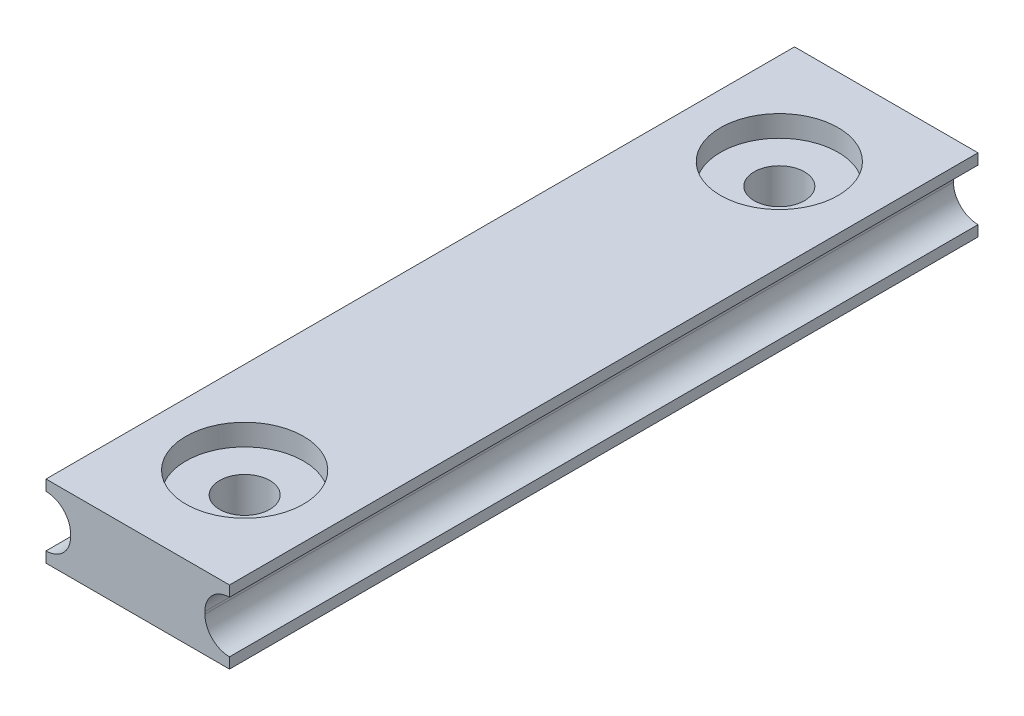
ISO-10303-21;
HEADER;
FILE_DESCRIPTION(('STEP AP214'),'2;1');
FILE_NAME('part.step','',(''),(''),'','','');
FILE_SCHEMA(('AUTOMOTIVE_DESIGN { 1 0 10303 214 1 1 1 1 }'));
ENDSEC;
DATA;
#1=APPLICATION_CONTEXT('core data for automotive mechanical design processes');
#2=APPLICATION_PROTOCOL_DEFINITION('international standard','automotive_design',2000,#1);
#3=PRODUCT_CONTEXT('',#1,'mechanical');
#4=PRODUCT('Part','Part','',(#3));
#5=PRODUCT_RELATED_PRODUCT_CATEGORY('part','',(#4));
#6=PRODUCT_DEFINITION_FORMATION('','',#4);
#7=PRODUCT_DEFINITION_CONTEXT('part definition',#1,'design');
#8=PRODUCT_DEFINITION('design','',#6,#7);
#9=PRODUCT_DEFINITION_SHAPE('','',#8);
#10=(LENGTH_UNIT() NAMED_UNIT(*) SI_UNIT(.MILLI.,.METRE.));
#11=(NAMED_UNIT(*) PLANE_ANGLE_UNIT() SI_UNIT($,.RADIAN.));
#12=(NAMED_UNIT(*) SI_UNIT($,.STERADIAN.) SOLID_ANGLE_UNIT());
#13=UNCERTAINTY_MEASURE_WITH_UNIT(LENGTH_MEASURE(1.E-05),#10,'distance_accuracy_value','');
#14=(GEOMETRIC_REPRESENTATION_CONTEXT(3) GLOBAL_UNCERTAINTY_ASSIGNED_CONTEXT((#13)) GLOBAL_UNIT_ASSIGNED_CONTEXT((#10,
#11,#12)) REPRESENTATION_CONTEXT('',''));
#15=CARTESIAN_POINT('',(0.,0.,0.));
#16=DIRECTION('',(0.,0.,1.));
#17=DIRECTION('',(1.,0.,0.));
#18=AXIS2_PLACEMENT_3D('',#15,#16,#17);
#19=CARTESIAN_POINT('',(-4.29,1.705,17.5));
#20=DIRECTION('',(0.,-1.,0.));
#21=DIRECTION('',(0.,0.,-1.));
#22=AXIS2_PLACEMENT_3D('',#19,#20,#21);
#23=PLANE('',#22);
#24=CARTESIAN_POINT('',(0.,1.705,-12.5));
#25=DIRECTION('',(0.,1.,0.));
#26=DIRECTION('',(0.,0.,1.));
#27=AXIS2_PLACEMENT_3D('',#24,#25,#26);
#28=CIRCLE('',#27,2.75);
#29=CARTESIAN_POINT('',(0.,1.705,-9.75));
#30=VERTEX_POINT('',#29);
#31=EDGE_CURVE('E210',#30,#30,#28,.T.);
#32=ORIENTED_EDGE('',*,*,#31,.F.);
#33=EDGE_LOOP('',(#32));
#34=FACE_BOUND('',#33,.T.);
#35=DIRECTION('',(-1.,0.,0.));
#36=VECTOR('',#35,1.);
#37=CARTESIAN_POINT('',(-4.29,1.705,-17.5));
#38=LINE('',#37,#36);
#39=CARTESIAN_POINT('',(4.29,1.705,-17.5));
#40=VERTEX_POINT('',#39);
#41=CARTESIAN_POINT('',(-4.29,1.705,-17.5));
#42=VERTEX_POINT('',#41);
#43=EDGE_CURVE('E99',#40,#42,#38,.T.);
#44=ORIENTED_EDGE('',*,*,#43,.T.);
#45=DIRECTION('',(0.,0.,-1.));
#46=VECTOR('',#45,1.);
#47=CARTESIAN_POINT('',(-4.29,1.705,17.5));
#48=LINE('',#47,#46);
#49=CARTESIAN_POINT('',(-4.29,1.705,17.5));
#50=VERTEX_POINT('',#49);
#51=EDGE_CURVE('E152',#50,#42,#48,.T.);
#52=ORIENTED_EDGE('',*,*,#51,.F.);
#53=DIRECTION('',(-1.,0.,0.));
#54=VECTOR('',#53,1.);
#55=CARTESIAN_POINT('',(-4.29,1.705,17.5));
#56=LINE('',#55,#54);
#57=CARTESIAN_POINT('',(4.29,1.705,17.5));
#58=VERTEX_POINT('',#57);
#59=EDGE_CURVE('E52',#58,#50,#56,.T.);
#60=ORIENTED_EDGE('',*,*,#59,.F.);
#61=DIRECTION('',(0.,0.,-1.));
#62=VECTOR('',#61,1.);
#63=CARTESIAN_POINT('',(4.29,1.705,17.5));
#64=LINE('',#63,#62);
#65=EDGE_CURVE('E148',#58,#40,#64,.T.);
#66=ORIENTED_EDGE('',*,*,#65,.T.);
#67=EDGE_LOOP('',(#44,#52,#60,#66));
#68=FACE_BOUND('',#67,.T.);
#69=CARTESIAN_POINT('',(0.,1.705,12.5));
#70=DIRECTION('',(0.,-1.,0.));
#71=DIRECTION('',(0.,0.,-1.));
#72=AXIS2_PLACEMENT_3D('',#69,#70,#71);
#73=CIRCLE('',#72,2.75);
#74=CARTESIAN_POINT('',(0.,1.705,9.75));
#75=VERTEX_POINT('',#74);
#76=EDGE_CURVE('E257',#75,#75,#73,.T.);
#77=ORIENTED_EDGE('',*,*,#76,.T.);
#78=EDGE_LOOP('',(#77));
#79=FACE_BOUND('',#78,.T.);
#80=ADVANCED_FACE('F33',(#34,#68,#79),#23,.F.);
#81=CARTESIAN_POINT('',(0.,-1.705,12.5));
#82=DIRECTION('',(0.,1.,0.));
#83=DIRECTION('',(0.,0.,1.));
#84=AXIS2_PLACEMENT_3D('',#81,#82,#83);
#85=CYLINDRICAL_SURFACE('',#84,1.175);
#86=CARTESIAN_POINT('',(0.,-1.705,12.5));
#87=DIRECTION('',(0.,-1.,0.));
#88=DIRECTION('',(0.,0.,-1.));
#89=AXIS2_PLACEMENT_3D('',#86,#87,#88);
#90=CIRCLE('',#89,1.175);
#91=CARTESIAN_POINT('',(0.,-1.705,11.325));
#92=VERTEX_POINT('',#91);
#93=EDGE_CURVE('E215',#92,#92,#90,.T.);
#94=ORIENTED_EDGE('',*,*,#93,.T.);
#95=EDGE_LOOP('',(#94));
#96=FACE_BOUND('',#95,.T.);
#97=CARTESIAN_POINT('',(0.,0.705,12.5));
#98=DIRECTION('',(0.,1.,0.));
#99=DIRECTION('',(0.,0.,1.));
#100=AXIS2_PLACEMENT_3D('',#97,#98,#99);
#101=CIRCLE('',#100,1.175);
#102=CARTESIAN_POINT('',(0.,0.705,13.675));
#103=VERTEX_POINT('',#102);
#104=EDGE_CURVE('E37',#103,#103,#101,.T.);
#105=ORIENTED_EDGE('',*,*,#104,.T.);
#106=EDGE_LOOP('',(#105));
#107=FACE_BOUND('',#106,.T.);
#108=ADVANCED_FACE('F252',(#96,#107),#85,.F.);
#109=CARTESIAN_POINT('',(-4.29,-1.705,17.5));
#110=DIRECTION('',(0.,1.,0.));
#111=DIRECTION('',(0.,0.,1.));
#112=AXIS2_PLACEMENT_3D('',#109,#110,#111);
#113=PLANE('',#112);
#114=DIRECTION('',(1.,0.,0.));
#115=VECTOR('',#114,1.);
#116=CARTESIAN_POINT('',(-4.29,-1.705,-17.5));
#117=LINE('',#116,#115);
#118=CARTESIAN_POINT('',(-4.29,-1.705,-17.5));
#119=VERTEX_POINT('',#118);
#120=CARTESIAN_POINT('',(4.29,-1.705,-17.5));
#121=VERTEX_POINT('',#120);
#122=EDGE_CURVE('E168',#119,#121,#117,.T.);
#123=ORIENTED_EDGE('',*,*,#122,.T.);
#124=DIRECTION('',(0.,0.,-1.));
#125=VECTOR('',#124,1.);
#126=CARTESIAN_POINT('',(4.29,-1.705,17.5));
#127=LINE('',#126,#125);
#128=CARTESIAN_POINT('',(4.29,-1.705,17.5));
#129=VERTEX_POINT('',#128);
#130=EDGE_CURVE('E189',#129,#121,#127,.T.);
#131=ORIENTED_EDGE('',*,*,#130,.F.);
#132=DIRECTION('',(1.,0.,0.));
#133=VECTOR('',#132,1.);
#134=CARTESIAN_POINT('',(-4.29,-1.705,17.5));
#135=LINE('',#134,#133);
#136=CARTESIAN_POINT('',(-4.29,-1.705,17.5));
#137=VERTEX_POINT('',#136);
#138=EDGE_CURVE('E228',#137,#129,#135,.T.);
#139=ORIENTED_EDGE('',*,*,#138,.F.);
#140=DIRECTION('',(0.,0.,-1.));
#141=VECTOR('',#140,1.);
#142=CARTESIAN_POINT('',(-4.29,-1.705,17.5));
#143=LINE('',#142,#141);
#144=EDGE_CURVE('E192',#137,#119,#143,.T.);
#145=ORIENTED_EDGE('',*,*,#144,.T.);
#146=EDGE_LOOP('',(#123,#131,#139,#145));
#147=FACE_BOUND('',#146,.T.);
#148=CARTESIAN_POINT('',(0.,-1.705,-12.5));
#149=DIRECTION('',(0.,1.,0.));
#150=DIRECTION('',(0.,0.,1.));
#151=AXIS2_PLACEMENT_3D('',#148,#149,#150);
#152=CIRCLE('',#151,1.175);
#153=CARTESIAN_POINT('',(0.,-1.705,-11.325));
#154=VERTEX_POINT('',#153);
#155=EDGE_CURVE('E160',#154,#154,#152,.T.);
#156=ORIENTED_EDGE('',*,*,#155,.T.);
#157=EDGE_LOOP('',(#156));
#158=FACE_BOUND('',#157,.T.);
#159=ORIENTED_EDGE('',*,*,#93,.F.);
#160=EDGE_LOOP('',(#159));
#161=FACE_BOUND('',#160,.T.);
#162=ADVANCED_FACE('F271',(#147,#158,#161),#113,.F.);
#163=CARTESIAN_POINT('',(0.,-1.705,-12.5));
#164=DIRECTION('',(0.,1.,0.));
#165=DIRECTION('',(0.,0.,1.));
#166=AXIS2_PLACEMENT_3D('',#163,#164,#165);
#167=CYLINDRICAL_SURFACE('',#166,1.175);
#168=ORIENTED_EDGE('',*,*,#155,.F.);
#169=EDGE_LOOP('',(#168));
#170=FACE_BOUND('',#169,.T.);
#171=CARTESIAN_POINT('',(0.,0.705,-12.5));
#172=DIRECTION('',(0.,1.,0.));
#173=DIRECTION('',(0.,0.,1.));
#174=AXIS2_PLACEMENT_3D('',#171,#172,#173);
#175=CIRCLE('',#174,1.175);
#176=CARTESIAN_POINT('',(0.,0.705,-11.325));
#177=VERTEX_POINT('',#176);
#178=EDGE_CURVE('E202',#177,#177,#175,.F.);
#179=ORIENTED_EDGE('',*,*,#178,.F.);
#180=EDGE_LOOP('',(#179));
#181=FACE_BOUND('',#180,.T.);
#182=ADVANCED_FACE('F273',(#170,#181),#167,.F.);
#183=CARTESIAN_POINT('',(-4.29,1.705,17.5));
#184=DIRECTION('',(1.,0.,0.));
#185=DIRECTION('',(0.,1.,0.));
#186=AXIS2_PLACEMENT_3D('',#183,#184,#185);
#187=PLANE('',#186);
#188=DIRECTION('',(0.,-1.,0.));
#189=VECTOR('',#188,1.);
#190=CARTESIAN_POINT('',(-4.29,1.705,-17.5));
#191=LINE('',#190,#189);
#192=CARTESIAN_POINT('',(-4.29,1.205,-17.5));
#193=VERTEX_POINT('',#192);
#194=EDGE_CURVE('E156',#42,#193,#191,.T.);
#195=ORIENTED_EDGE('',*,*,#194,.T.);
#196=DIRECTION('',(0.,0.,-1.));
#197=VECTOR('',#196,1.);
#198=CARTESIAN_POINT('',(-4.29,1.205,17.5));
#199=LINE('',#198,#197);
#200=CARTESIAN_POINT('',(-4.29,1.205,17.5));
#201=VERTEX_POINT('',#200);
#202=EDGE_CURVE('E11',#201,#193,#199,.T.);
#203=ORIENTED_EDGE('',*,*,#202,.F.);
#204=DIRECTION('',(0.,-1.,0.));
#205=VECTOR('',#204,1.);
#206=CARTESIAN_POINT('',(-4.29,1.705,17.5));
#207=LINE('',#206,#205);
#208=EDGE_CURVE('E179',#50,#201,#207,.T.);
#209=ORIENTED_EDGE('',*,*,#208,.F.);
#210=ORIENTED_EDGE('',*,*,#51,.T.);
#211=EDGE_LOOP('',(#195,#203,#209,#210));
#212=FACE_BOUND('',#211,.T.);
#213=ADVANCED_FACE('F35',(#212),#187,.F.);
#214=CARTESIAN_POINT('',(-4.29,0.0550000000000001,17.5));
#215=DIRECTION('',(0.,0.,-1.));
#216=DIRECTION('',(-1.,0.,0.));
#217=AXIS2_PLACEMENT_3D('',#214,#215,#216);
#218=CYLINDRICAL_SURFACE('',#217,1.15);
#219=CARTESIAN_POINT('',(-4.29,0.0550000000000001,-17.5));
#220=DIRECTION('',(0.,0.,-1.));
#221=DIRECTION('',(1.,0.,0.));
#222=AXIS2_PLACEMENT_3D('',#219,#220,#221);
#223=CIRCLE('',#222,1.15);
#224=CARTESIAN_POINT('',(-3.14,0.0550000000000001,-17.5));
#225=VERTEX_POINT('',#224);
#226=EDGE_CURVE('E159',#193,#225,#223,.T.);
#227=ORIENTED_EDGE('',*,*,#226,.T.);
#228=DIRECTION('',(0.,0.,-1.));
#229=VECTOR('',#228,1.);
#230=CARTESIAN_POINT('',(-3.14,0.0550000000000001,17.5));
#231=LINE('',#230,#229);
#232=CARTESIAN_POINT('',(-3.14,0.0550000000000001,17.5));
#233=VERTEX_POINT('',#232);
#234=EDGE_CURVE('E43',#233,#225,#231,.T.);
#235=ORIENTED_EDGE('',*,*,#234,.F.);
#236=CARTESIAN_POINT('',(-4.29,0.0550000000000001,17.5));
#237=DIRECTION('',(0.,0.,-1.));
#238=DIRECTION('',(1.,0.,0.));
#239=AXIS2_PLACEMENT_3D('',#236,#237,#238);
#240=CIRCLE('',#239,1.15);
#241=EDGE_CURVE('E107',#201,#233,#240,.T.);
#242=ORIENTED_EDGE('',*,*,#241,.F.);
#243=ORIENTED_EDGE('',*,*,#202,.T.);
#244=EDGE_LOOP('',(#227,#235,#242,#243));
#245=FACE_BOUND('',#244,.T.);
#246=ADVANCED_FACE('F298',(#245),#218,.F.);
#247=CARTESIAN_POINT('',(-3.14,0.0550000000000001,17.5));
#248=DIRECTION('',(1.,0.,0.));
#249=DIRECTION('',(0.,0.,-1.));
#250=AXIS2_PLACEMENT_3D('',#247,#248,#249);
#251=PLANE('',#250);
#252=DIRECTION('',(0.,-1.,0.));
#253=VECTOR('',#252,1.);
#254=CARTESIAN_POINT('',(-3.14,0.0550000000000001,-17.5));
#255=LINE('',#254,#253);
#256=CARTESIAN_POINT('',(-3.14,-0.0549999999999997,-17.5));
#257=VERTEX_POINT('',#256);
#258=EDGE_CURVE('E162',#225,#257,#255,.T.);
#259=ORIENTED_EDGE('',*,*,#258,.T.);
#260=DIRECTION('',(0.,0.,-1.));
#261=VECTOR('',#260,1.);
#262=CARTESIAN_POINT('',(-3.14,-0.0549999999999997,17.5));
#263=LINE('',#262,#261);
#264=CARTESIAN_POINT('',(-3.14,-0.0549999999999997,17.5));
#265=VERTEX_POINT('',#264);
#266=EDGE_CURVE('E198',#265,#257,#263,.T.);
#267=ORIENTED_EDGE('',*,*,#266,.F.);
#268=DIRECTION('',(0.,-1.,0.));
#269=VECTOR('',#268,1.);
#270=CARTESIAN_POINT('',(-3.14,0.0550000000000001,17.5));
#271=LINE('',#270,#269);
#272=EDGE_CURVE('E222',#233,#265,#271,.T.);
#273=ORIENTED_EDGE('',*,*,#272,.F.);
#274=ORIENTED_EDGE('',*,*,#234,.T.);
#275=EDGE_LOOP('',(#259,#267,#273,#274));
#276=FACE_BOUND('',#275,.T.);
#277=ADVANCED_FACE('F295',(#276),#251,.F.);
#278=CARTESIAN_POINT('',(-4.29,-0.0549999999999999,17.5));
#279=DIRECTION('',(0.,0.,-1.));
#280=DIRECTION('',(-1.,0.,0.));
#281=AXIS2_PLACEMENT_3D('',#278,#279,#280);
#282=CYLINDRICAL_SURFACE('',#281,1.15);
#283=CARTESIAN_POINT('',(-4.29,-0.0549999999999999,-17.5));
#284=DIRECTION('',(0.,0.,-1.));
#285=DIRECTION('',(-1.,0.,0.));
#286=AXIS2_PLACEMENT_3D('',#283,#284,#285);
#287=CIRCLE('',#286,1.15);
#288=CARTESIAN_POINT('',(-4.29,-1.205,-17.5));
#289=VERTEX_POINT('',#288);
#290=EDGE_CURVE('E164',#257,#289,#287,.T.);
#291=ORIENTED_EDGE('',*,*,#290,.T.);
#292=DIRECTION('',(0.,0.,-1.));
#293=VECTOR('',#292,1.);
#294=CARTESIAN_POINT('',(-4.29,-1.205,17.5));
#295=LINE('',#294,#293);
#296=CARTESIAN_POINT('',(-4.29,-1.205,17.5));
#297=VERTEX_POINT('',#296);
#298=EDGE_CURVE('E195',#297,#289,#295,.T.);
#299=ORIENTED_EDGE('',*,*,#298,.F.);
#300=CARTESIAN_POINT('',(-4.29,-0.0549999999999999,17.5));
#301=DIRECTION('',(0.,0.,-1.));
#302=DIRECTION('',(-1.,0.,0.));
#303=AXIS2_PLACEMENT_3D('',#300,#301,#302);
#304=CIRCLE('',#303,1.15);
#305=EDGE_CURVE('E224',#265,#297,#304,.T.);
#306=ORIENTED_EDGE('',*,*,#305,.F.);
#307=ORIENTED_EDGE('',*,*,#266,.T.);
#308=EDGE_LOOP('',(#291,#299,#306,#307));
#309=FACE_BOUND('',#308,.T.);
#310=ADVANCED_FACE('F291',(#309),#282,.F.);
#311=CARTESIAN_POINT('',(-4.29,-1.205,17.5));
#312=DIRECTION('',(1.,0.,0.));
#313=DIRECTION('',(0.,1.,0.));
#314=AXIS2_PLACEMENT_3D('',#311,#312,#313);
#315=PLANE('',#314);
#316=DIRECTION('',(0.,-1.,0.));
#317=VECTOR('',#316,1.);
#318=CARTESIAN_POINT('',(-4.29,-1.205,-17.5));
#319=LINE('',#318,#317);
#320=EDGE_CURVE('E166',#289,#119,#319,.T.);
#321=ORIENTED_EDGE('',*,*,#320,.T.);
#322=ORIENTED_EDGE('',*,*,#144,.F.);
#323=DIRECTION('',(0.,-1.,0.));
#324=VECTOR('',#323,1.);
#325=CARTESIAN_POINT('',(-4.29,-1.205,17.5));
#326=LINE('',#325,#324);
#327=EDGE_CURVE('E226',#297,#137,#326,.T.);
#328=ORIENTED_EDGE('',*,*,#327,.F.);
#329=ORIENTED_EDGE('',*,*,#298,.T.);
#330=EDGE_LOOP('',(#321,#322,#328,#329));
#331=FACE_BOUND('',#330,.T.);
#332=ADVANCED_FACE('F288',(#331),#315,.F.);
#333=CARTESIAN_POINT('',(4.29,-1.205,17.5));
#334=DIRECTION('',(-1.,0.,0.));
#335=DIRECTION('',(0.,-1.,0.));
#336=AXIS2_PLACEMENT_3D('',#333,#334,#335);
#337=PLANE('',#336);
#338=DIRECTION('',(0.,1.,0.));
#339=VECTOR('',#338,1.);
#340=CARTESIAN_POINT('',(4.29,-1.205,-17.5));
#341=LINE('',#340,#339);
#342=CARTESIAN_POINT('',(4.29,-1.205,-17.5));
#343=VERTEX_POINT('',#342);
#344=EDGE_CURVE('E170',#121,#343,#341,.T.);
#345=ORIENTED_EDGE('',*,*,#344,.T.);
#346=DIRECTION('',(0.,0.,-1.));
#347=VECTOR('',#346,1.);
#348=CARTESIAN_POINT('',(4.29,-1.205,17.5));
#349=LINE('',#348,#347);
#350=CARTESIAN_POINT('',(4.29,-1.205,17.5));
#351=VERTEX_POINT('',#350);
#352=EDGE_CURVE('E186',#351,#343,#349,.T.);
#353=ORIENTED_EDGE('',*,*,#352,.F.);
#354=DIRECTION('',(0.,1.,0.));
#355=VECTOR('',#354,1.);
#356=CARTESIAN_POINT('',(4.29,-1.205,17.5));
#357=LINE('',#356,#355);
#358=EDGE_CURVE('E230',#129,#351,#357,.T.);
#359=ORIENTED_EDGE('',*,*,#358,.F.);
#360=ORIENTED_EDGE('',*,*,#130,.T.);
#361=EDGE_LOOP('',(#345,#353,#359,#360));
#362=FACE_BOUND('',#361,.T.);
#363=ADVANCED_FACE('F286',(#362),#337,.F.);
#364=CARTESIAN_POINT('',(4.29,-0.0549999999999999,17.5));
#365=DIRECTION('',(0.,0.,-1.));
#366=DIRECTION('',(-1.,0.,0.));
#367=AXIS2_PLACEMENT_3D('',#364,#365,#366);
#368=CYLINDRICAL_SURFACE('',#367,1.15);
#369=CARTESIAN_POINT('',(4.29,-0.0549999999999999,-17.5));
#370=DIRECTION('',(0.,0.,-1.));
#371=DIRECTION('',(1.,0.,0.));
#372=AXIS2_PLACEMENT_3D('',#369,#370,#371);
#373=CIRCLE('',#372,1.15);
#374=CARTESIAN_POINT('',(3.14,-0.0549999999999999,-17.5));
#375=VERTEX_POINT('',#374);
#376=EDGE_CURVE('E172',#343,#375,#373,.T.);
#377=ORIENTED_EDGE('',*,*,#376,.T.);
#378=DIRECTION('',(0.,0.,-1.));
#379=VECTOR('',#378,1.);
#380=CARTESIAN_POINT('',(3.14,-0.0549999999999999,17.5));
#381=LINE('',#380,#379);
#382=CARTESIAN_POINT('',(3.14,-0.0549999999999999,17.5));
#383=VERTEX_POINT('',#382);
#384=EDGE_CURVE('E183',#383,#375,#381,.T.);
#385=ORIENTED_EDGE('',*,*,#384,.F.);
#386=CARTESIAN_POINT('',(4.29,-0.0549999999999999,17.5));
#387=DIRECTION('',(0.,0.,-1.));
#388=DIRECTION('',(1.,0.,0.));
#389=AXIS2_PLACEMENT_3D('',#386,#387,#388);
#390=CIRCLE('',#389,1.15);
#391=EDGE_CURVE('E232',#351,#383,#390,.T.);
#392=ORIENTED_EDGE('',*,*,#391,.F.);
#393=ORIENTED_EDGE('',*,*,#352,.T.);
#394=EDGE_LOOP('',(#377,#385,#392,#393));
#395=FACE_BOUND('',#394,.T.);
#396=ADVANCED_FACE('F238',(#395),#368,.F.);
#397=CARTESIAN_POINT('',(3.14,0.0550000000000001,17.5));
#398=DIRECTION('',(-1.,0.,0.));
#399=DIRECTION('',(0.,0.,1.));
#400=AXIS2_PLACEMENT_3D('',#397,#398,#399);
#401=PLANE('',#400);
#402=DIRECTION('',(0.,1.,0.));
#403=VECTOR('',#402,1.);
#404=CARTESIAN_POINT('',(3.14,0.0550000000000001,-17.5));
#405=LINE('',#404,#403);
#406=CARTESIAN_POINT('',(3.14,0.0550000000000001,-17.5));
#407=VERTEX_POINT('',#406);
#408=EDGE_CURVE('E174',#375,#407,#405,.T.);
#409=ORIENTED_EDGE('',*,*,#408,.T.);
#410=DIRECTION('',(0.,0.,-1.));
#411=VECTOR('',#410,1.);
#412=CARTESIAN_POINT('',(3.14,0.0550000000000001,17.5));
#413=LINE('',#412,#411);
#414=CARTESIAN_POINT('',(3.14,0.0550000000000001,17.5));
#415=VERTEX_POINT('',#414);
#416=EDGE_CURVE('E147',#415,#407,#413,.T.);
#417=ORIENTED_EDGE('',*,*,#416,.F.);
#418=DIRECTION('',(0.,1.,0.));
#419=VECTOR('',#418,1.);
#420=CARTESIAN_POINT('',(3.14,0.0550000000000001,17.5));
#421=LINE('',#420,#419);
#422=EDGE_CURVE('E138',#383,#415,#421,.T.);
#423=ORIENTED_EDGE('',*,*,#422,.F.);
#424=ORIENTED_EDGE('',*,*,#384,.T.);
#425=EDGE_LOOP('',(#409,#417,#423,#424));
#426=FACE_BOUND('',#425,.T.);
#427=ADVANCED_FACE('F242',(#426),#401,.F.);
#428=CARTESIAN_POINT('',(4.29,0.0550000000000001,17.5));
#429=DIRECTION('',(0.,0.,-1.));
#430=DIRECTION('',(-1.,0.,0.));
#431=AXIS2_PLACEMENT_3D('',#428,#429,#430);
#432=CYLINDRICAL_SURFACE('',#431,1.15);
#433=CARTESIAN_POINT('',(4.29,0.0550000000000001,-17.5));
#434=DIRECTION('',(0.,0.,-1.));
#435=DIRECTION('',(-1.,0.,0.));
#436=AXIS2_PLACEMENT_3D('',#433,#434,#435);
#437=CIRCLE('',#436,1.15);
#438=CARTESIAN_POINT('',(4.29,1.205,-17.5));
#439=VERTEX_POINT('',#438);
#440=EDGE_CURVE('E146',#407,#439,#437,.T.);
#441=ORIENTED_EDGE('',*,*,#440,.T.);
#442=DIRECTION('',(0.,0.,-1.));
#443=VECTOR('',#442,1.);
#444=CARTESIAN_POINT('',(4.29,1.205,17.5));
#445=LINE('',#444,#443);
#446=CARTESIAN_POINT('',(4.29,1.205,17.5));
#447=VERTEX_POINT('',#446);
#448=EDGE_CURVE('E143',#447,#439,#445,.T.);
#449=ORIENTED_EDGE('',*,*,#448,.F.);
#450=CARTESIAN_POINT('',(4.29,0.0550000000000001,17.5));
#451=DIRECTION('',(0.,0.,-1.));
#452=DIRECTION('',(-1.,0.,0.));
#453=AXIS2_PLACEMENT_3D('',#450,#451,#452);
#454=CIRCLE('',#453,1.15);
#455=EDGE_CURVE('E132',#415,#447,#454,.T.);
#456=ORIENTED_EDGE('',*,*,#455,.F.);
#457=ORIENTED_EDGE('',*,*,#416,.T.);
#458=EDGE_LOOP('',(#441,#449,#456,#457));
#459=FACE_BOUND('',#458,.T.);
#460=ADVANCED_FACE('F144',(#459),#432,.F.);
#461=CARTESIAN_POINT('',(4.29,1.705,17.5));
#462=DIRECTION('',(-1.,0.,0.));
#463=DIRECTION('',(0.,-1.,0.));
#464=AXIS2_PLACEMENT_3D('',#461,#462,#463);
#465=PLANE('',#464);
#466=DIRECTION('',(0.,1.,0.));
#467=VECTOR('',#466,1.);
#468=CARTESIAN_POINT('',(4.29,1.705,-17.5));
#469=LINE('',#468,#467);
#470=EDGE_CURVE('E93',#439,#40,#469,.T.);
#471=ORIENTED_EDGE('',*,*,#470,.T.);
#472=ORIENTED_EDGE('',*,*,#65,.F.);
#473=DIRECTION('',(0.,1.,0.));
#474=VECTOR('',#473,1.);
#475=CARTESIAN_POINT('',(4.29,1.705,17.5));
#476=LINE('',#475,#474);
#477=EDGE_CURVE('E136',#447,#58,#476,.T.);
#478=ORIENTED_EDGE('',*,*,#477,.F.);
#479=ORIENTED_EDGE('',*,*,#448,.T.);
#480=EDGE_LOOP('',(#471,#472,#478,#479));
#481=FACE_BOUND('',#480,.T.);
#482=ADVANCED_FACE('F150',(#481),#465,.F.);
#483=CARTESIAN_POINT('',(-4.29,0.0550000000000001,17.5));
#484=DIRECTION('',(0.,0.,1.));
#485=DIRECTION('',(1.,0.,0.));
#486=AXIS2_PLACEMENT_3D('',#483,#484,#485);
#487=PLANE('',#486);
#488=ORIENTED_EDGE('',*,*,#208,.T.);
#489=ORIENTED_EDGE('',*,*,#241,.T.);
#490=ORIENTED_EDGE('',*,*,#272,.T.);
#491=ORIENTED_EDGE('',*,*,#305,.T.);
#492=ORIENTED_EDGE('',*,*,#327,.T.);
#493=ORIENTED_EDGE('',*,*,#138,.T.);
#494=ORIENTED_EDGE('',*,*,#358,.T.);
#495=ORIENTED_EDGE('',*,*,#391,.T.);
#496=ORIENTED_EDGE('',*,*,#422,.T.);
#497=ORIENTED_EDGE('',*,*,#455,.T.);
#498=ORIENTED_EDGE('',*,*,#477,.T.);
#499=ORIENTED_EDGE('',*,*,#59,.T.);
#500=EDGE_LOOP('',(#488,#489,#490,#491,#492,#493,#494,#495,#496,#497,#498,#499));
#501=FACE_BOUND('',#500,.T.);
#502=ADVANCED_FACE('F134',(#501),#487,.T.);
#503=CARTESIAN_POINT('',(-4.29,0.0550000000000001,-17.5));
#504=DIRECTION('',(0.,0.,1.));
#505=DIRECTION('',(1.,0.,0.));
#506=AXIS2_PLACEMENT_3D('',#503,#504,#505);
#507=PLANE('',#506);
#508=ORIENTED_EDGE('',*,*,#194,.F.);
#509=ORIENTED_EDGE('',*,*,#43,.F.);
#510=ORIENTED_EDGE('',*,*,#470,.F.);
#511=ORIENTED_EDGE('',*,*,#440,.F.);
#512=ORIENTED_EDGE('',*,*,#408,.F.);
#513=ORIENTED_EDGE('',*,*,#376,.F.);
#514=ORIENTED_EDGE('',*,*,#344,.F.);
#515=ORIENTED_EDGE('',*,*,#122,.F.);
#516=ORIENTED_EDGE('',*,*,#320,.F.);
#517=ORIENTED_EDGE('',*,*,#290,.F.);
#518=ORIENTED_EDGE('',*,*,#258,.F.);
#519=ORIENTED_EDGE('',*,*,#226,.F.);
#520=EDGE_LOOP('',(#508,#509,#510,#511,#512,#513,#514,#515,#516,#517,#518,#519));
#521=FACE_BOUND('',#520,.T.);
#522=ADVANCED_FACE('F245',(#521),#507,.F.);
#523=CARTESIAN_POINT('',(0.,0.705,-12.5));
#524=DIRECTION('',(0.,1.,0.));
#525=DIRECTION('',(0.,0.,1.));
#526=AXIS2_PLACEMENT_3D('',#523,#524,#525);
#527=PLANE('',#526);
#528=CARTESIAN_POINT('',(0.,0.705,-12.5));
#529=DIRECTION('',(0.,1.,0.));
#530=DIRECTION('',(0.,0.,1.));
#531=AXIS2_PLACEMENT_3D('',#528,#529,#530);
#532=CIRCLE('',#531,2.75);
#533=CARTESIAN_POINT('',(0.,0.705,-9.75));
#534=VERTEX_POINT('',#533);
#535=EDGE_CURVE('E204',#534,#534,#532,.T.);
#536=ORIENTED_EDGE('',*,*,#535,.T.);
#537=EDGE_LOOP('',(#536));
#538=FACE_BOUND('',#537,.T.);
#539=ORIENTED_EDGE('',*,*,#178,.T.);
#540=EDGE_LOOP('',(#539));
#541=FACE_BOUND('',#540,.T.);
#542=ADVANCED_FACE('F332',(#538,#541),#527,.T.);
#543=CARTESIAN_POINT('',(0.,0.705,-12.5));
#544=DIRECTION('',(0.,1.,0.));
#545=DIRECTION('',(0.,0.,1.));
#546=AXIS2_PLACEMENT_3D('',#543,#544,#545);
#547=CYLINDRICAL_SURFACE('',#546,2.75);
#548=ORIENTED_EDGE('',*,*,#535,.F.);
#549=EDGE_LOOP('',(#548));
#550=FACE_BOUND('',#549,.T.);
#551=ORIENTED_EDGE('',*,*,#31,.T.);
#552=EDGE_LOOP('',(#551));
#553=FACE_BOUND('',#552,.T.);
#554=ADVANCED_FACE('F335',(#550,#553),#547,.F.);
#555=CARTESIAN_POINT('',(0.,0.705,12.5));
#556=DIRECTION('',(0.,1.,0.));
#557=DIRECTION('',(0.,0.,1.));
#558=AXIS2_PLACEMENT_3D('',#555,#556,#557);
#559=CYLINDRICAL_SURFACE('',#558,2.75);
#560=CARTESIAN_POINT('',(0.,0.705,12.5));
#561=DIRECTION('',(0.,-1.,0.));
#562=DIRECTION('',(0.,0.,-1.));
#563=AXIS2_PLACEMENT_3D('',#560,#561,#562);
#564=CIRCLE('',#563,2.75);
#565=CARTESIAN_POINT('',(0.,0.705,9.75));
#566=VERTEX_POINT('',#565);
#567=EDGE_CURVE('E259',#566,#566,#564,.T.);
#568=ORIENTED_EDGE('',*,*,#567,.T.);
#569=EDGE_LOOP('',(#568));
#570=FACE_BOUND('',#569,.T.);
#571=ORIENTED_EDGE('',*,*,#76,.F.);
#572=EDGE_LOOP('',(#571));
#573=FACE_BOUND('',#572,.T.);
#574=ADVANCED_FACE('F338',(#570,#573),#559,.F.);
#575=CARTESIAN_POINT('',(0.,0.705,12.5));
#576=DIRECTION('',(0.,1.,0.));
#577=DIRECTION('',(0.,0.,-1.));
#578=AXIS2_PLACEMENT_3D('',#575,#576,#577);
#579=PLANE('',#578);
#580=ORIENTED_EDGE('',*,*,#104,.F.);
#581=EDGE_LOOP('',(#580));
#582=FACE_BOUND('',#581,.T.);
#583=ORIENTED_EDGE('',*,*,#567,.F.);
#584=EDGE_LOOP('',(#583));
#585=FACE_BOUND('',#584,.T.);
#586=ADVANCED_FACE('F344',(#582,#585),#579,.T.);
#587=CLOSED_SHELL('',(#80,#108,#162,#182,#213,#246,#277,#310,#332,#363,#396,#427,#460,#482,#502,
#522,#542,#554,#574,#586));
#588=MANIFOLD_SOLID_BREP('B2',#587);
#589=ADVANCED_BREP_SHAPE_REPRESENTATION('',(#18,#588),#14);
#590=SHAPE_DEFINITION_REPRESENTATION(#9,#589);
ENDSEC;
END-ISO-10303-21;
